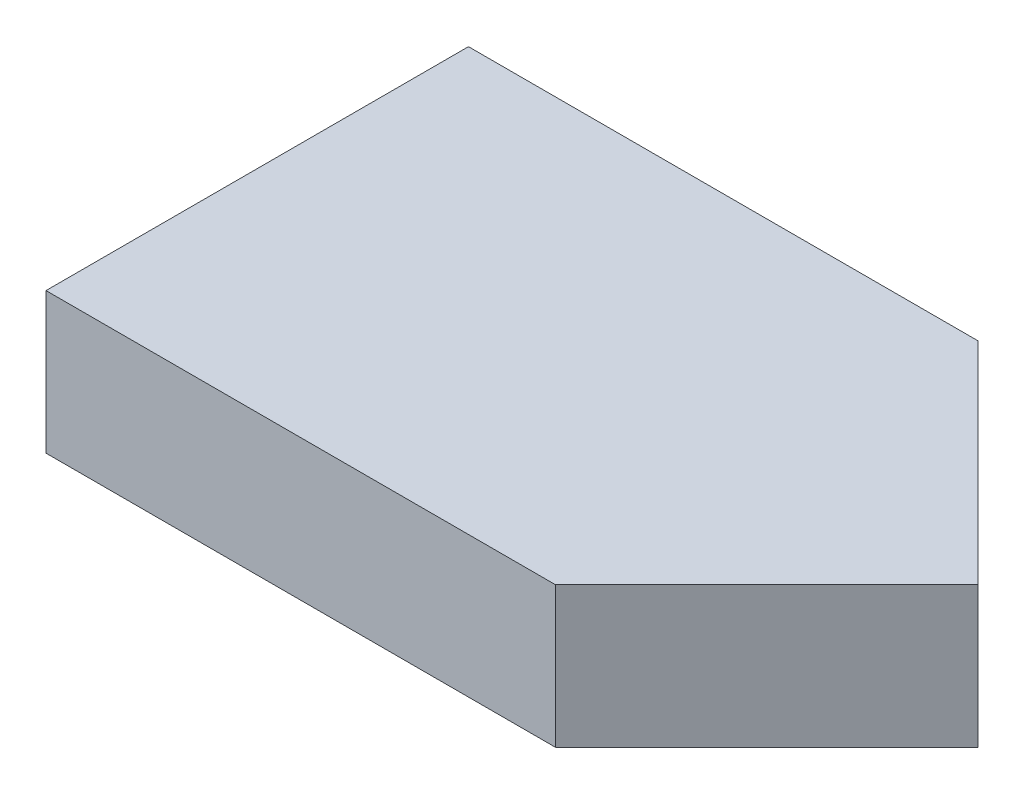
ISO-10303-21;
HEADER;
FILE_DESCRIPTION(('STEP AP214'),'2;1');
FILE_NAME('part.step','',(''),(''),'','','');
FILE_SCHEMA(('AUTOMOTIVE_DESIGN { 1 0 10303 214 1 1 1 1 }'));
ENDSEC;
DATA;
#1=APPLICATION_CONTEXT('core data for automotive mechanical design processes');
#2=APPLICATION_PROTOCOL_DEFINITION('international standard','automotive_design',2000,#1);
#3=PRODUCT_CONTEXT('',#1,'mechanical');
#4=PRODUCT('Part','Part','',(#3));
#5=PRODUCT_RELATED_PRODUCT_CATEGORY('part','',(#4));
#6=PRODUCT_DEFINITION_FORMATION('','',#4);
#7=PRODUCT_DEFINITION_CONTEXT('part definition',#1,'design');
#8=PRODUCT_DEFINITION('design','',#6,#7);
#9=PRODUCT_DEFINITION_SHAPE('','',#8);
#10=(LENGTH_UNIT() NAMED_UNIT(*) SI_UNIT(.MILLI.,.METRE.));
#11=(NAMED_UNIT(*) PLANE_ANGLE_UNIT() SI_UNIT($,.RADIAN.));
#12=(NAMED_UNIT(*) SI_UNIT($,.STERADIAN.) SOLID_ANGLE_UNIT());
#13=UNCERTAINTY_MEASURE_WITH_UNIT(LENGTH_MEASURE(1.E-05),#10,'distance_accuracy_value','');
#14=(GEOMETRIC_REPRESENTATION_CONTEXT(3) GLOBAL_UNCERTAINTY_ASSIGNED_CONTEXT((#13)) GLOBAL_UNIT_ASSIGNED_CONTEXT((#10,
#11,#12)) REPRESENTATION_CONTEXT('',''));
#15=CARTESIAN_POINT('',(0.,0.,0.));
#16=DIRECTION('',(0.,0.,1.));
#17=DIRECTION('',(1.,0.,0.));
#18=AXIS2_PLACEMENT_3D('',#15,#16,#17);
#19=CARTESIAN_POINT('',(38.8259698766486,25.4,-129.274030123351));
#20=DIRECTION('',(0.707106781186548,0.,-0.707106781186547));
#21=DIRECTION('',(-0.707106781186547,0.,-0.707106781186548));
#22=AXIS2_PLACEMENT_3D('',#19,#20,#21);
#23=PLANE('',#22);
#24=DIRECTION('',(0.707106781186547,0.,0.707106781186548));
#25=VECTOR('',#24,1.);
#26=CARTESIAN_POINT('',(38.8259698766486,0.,-129.274030123351));
#27=LINE('',#26,#25);
#28=CARTESIAN_POINT('',(91.9,0.,-76.2));
#29=VERTEX_POINT('',#28);
#30=CARTESIAN_POINT('',(130.,0.,-38.1));
#31=VERTEX_POINT('',#30);
#32=EDGE_CURVE('E108',#29,#31,#27,.T.);
#33=ORIENTED_EDGE('',*,*,#32,.F.);
#34=DIRECTION('',(0.,-1.,0.));
#35=VECTOR('',#34,1.);
#36=CARTESIAN_POINT('',(91.9,25.4,-76.2));
#37=LINE('',#36,#35);
#38=CARTESIAN_POINT('',(91.9,25.4,-76.2));
#39=VERTEX_POINT('',#38);
#40=EDGE_CURVE('E11',#39,#29,#37,.T.);
#41=ORIENTED_EDGE('',*,*,#40,.F.);
#42=DIRECTION('',(0.707106781186547,0.,0.707106781186548));
#43=VECTOR('',#42,1.);
#44=CARTESIAN_POINT('',(38.8259698766486,25.4,-129.274030123351));
#45=LINE('',#44,#43);
#46=CARTESIAN_POINT('',(130.,25.4,-38.1));
#47=VERTEX_POINT('',#46);
#48=EDGE_CURVE('E103',#39,#47,#45,.T.);
#49=ORIENTED_EDGE('',*,*,#48,.T.);
#50=DIRECTION('',(0.,-1.,0.));
#51=VECTOR('',#50,1.);
#52=CARTESIAN_POINT('',(130.,25.4,-38.1));
#53=LINE('',#52,#51);
#54=EDGE_CURVE('E49',#47,#31,#53,.T.);
#55=ORIENTED_EDGE('',*,*,#54,.T.);
#56=EDGE_LOOP('',(#33,#41,#49,#55));
#57=FACE_BOUND('',#56,.T.);
#58=ADVANCED_FACE('F33',(#57),#23,.T.);
#59=CARTESIAN_POINT('',(-52.3480602467029,25.4,-76.2));
#60=DIRECTION('',(0.,0.,-1.));
#61=DIRECTION('',(-1.,0.,0.));
#62=AXIS2_PLACEMENT_3D('',#59,#60,#61);
#63=PLANE('',#62);
#64=DIRECTION('',(1.,0.,0.));
#65=VECTOR('',#64,1.);
#66=CARTESIAN_POINT('',(-52.3480602467029,0.,-76.2));
#67=LINE('',#66,#65);
#68=CARTESIAN_POINT('',(0.,0.,-76.2));
#69=VERTEX_POINT('',#68);
#70=EDGE_CURVE('E110',#69,#29,#67,.T.);
#71=ORIENTED_EDGE('',*,*,#70,.F.);
#72=DIRECTION('',(0.,-1.,0.));
#73=VECTOR('',#72,1.);
#74=CARTESIAN_POINT('',(0.,25.4,-76.2));
#75=LINE('',#74,#73);
#76=CARTESIAN_POINT('',(0.,25.4,-76.2));
#77=VERTEX_POINT('',#76);
#78=EDGE_CURVE('E41',#77,#69,#75,.T.);
#79=ORIENTED_EDGE('',*,*,#78,.F.);
#80=DIRECTION('',(1.,0.,0.));
#81=VECTOR('',#80,1.);
#82=CARTESIAN_POINT('',(-52.3480602467029,25.4,-76.2));
#83=LINE('',#82,#81);
#84=EDGE_CURVE('E101',#77,#39,#83,.T.);
#85=ORIENTED_EDGE('',*,*,#84,.T.);
#86=ORIENTED_EDGE('',*,*,#40,.T.);
#87=EDGE_LOOP('',(#71,#79,#85,#86));
#88=FACE_BOUND('',#87,.T.);
#89=ADVANCED_FACE('F122',(#88),#63,.T.);
#90=CARTESIAN_POINT('',(0.,25.4,-38.1));
#91=DIRECTION('',(-1.,0.,0.));
#92=DIRECTION('',(0.,0.,1.));
#93=AXIS2_PLACEMENT_3D('',#90,#91,#92);
#94=PLANE('',#93);
#95=DIRECTION('',(0.,0.,-1.));
#96=VECTOR('',#95,1.);
#97=CARTESIAN_POINT('',(0.,0.,-38.1));
#98=LINE('',#97,#96);
#99=CARTESIAN_POINT('',(0.,0.,0.));
#100=VERTEX_POINT('',#99);
#101=EDGE_CURVE('E88',#100,#69,#98,.T.);
#102=ORIENTED_EDGE('',*,*,#101,.F.);
#103=DIRECTION('',(0.,-1.,0.));
#104=VECTOR('',#103,1.);
#105=CARTESIAN_POINT('',(0.,25.4,0.));
#106=LINE('',#105,#104);
#107=CARTESIAN_POINT('',(0.,25.4,0.));
#108=VERTEX_POINT('',#107);
#109=EDGE_CURVE('E82',#108,#100,#106,.T.);
#110=ORIENTED_EDGE('',*,*,#109,.F.);
#111=DIRECTION('',(0.,0.,-1.));
#112=VECTOR('',#111,1.);
#113=CARTESIAN_POINT('',(0.,25.4,-38.1));
#114=LINE('',#113,#112);
#115=EDGE_CURVE('E86',#108,#77,#114,.T.);
#116=ORIENTED_EDGE('',*,*,#115,.T.);
#117=ORIENTED_EDGE('',*,*,#78,.T.);
#118=EDGE_LOOP('',(#102,#110,#116,#117));
#119=FACE_BOUND('',#118,.T.);
#120=ADVANCED_FACE('F84',(#119),#94,.T.);
#121=CARTESIAN_POINT('',(-52.3480602467029,25.4,0.));
#122=DIRECTION('',(0.,0.,-1.));
#123=DIRECTION('',(-1.,0.,0.));
#124=AXIS2_PLACEMENT_3D('',#121,#122,#123);
#125=PLANE('',#124);
#126=DIRECTION('',(1.,0.,0.));
#127=VECTOR('',#126,1.);
#128=CARTESIAN_POINT('',(-52.3480602467029,0.,0.));
#129=LINE('',#128,#127);
#130=CARTESIAN_POINT('',(91.9,0.,0.));
#131=VERTEX_POINT('',#130);
#132=EDGE_CURVE('E114',#100,#131,#129,.T.);
#133=ORIENTED_EDGE('',*,*,#132,.T.);
#134=DIRECTION('',(0.,-1.,0.));
#135=VECTOR('',#134,1.);
#136=CARTESIAN_POINT('',(91.9,25.4,0.));
#137=LINE('',#136,#135);
#138=CARTESIAN_POINT('',(91.9,25.4,0.));
#139=VERTEX_POINT('',#138);
#140=EDGE_CURVE('E66',#139,#131,#137,.T.);
#141=ORIENTED_EDGE('',*,*,#140,.F.);
#142=DIRECTION('',(1.,0.,0.));
#143=VECTOR('',#142,1.);
#144=CARTESIAN_POINT('',(-52.3480602467029,25.4,0.));
#145=LINE('',#144,#143);
#146=EDGE_CURVE('E92',#108,#139,#145,.T.);
#147=ORIENTED_EDGE('',*,*,#146,.F.);
#148=ORIENTED_EDGE('',*,*,#109,.T.);
#149=EDGE_LOOP('',(#133,#141,#147,#148));
#150=FACE_BOUND('',#149,.T.);
#151=ADVANCED_FACE('F93',(#150),#125,.F.);
#152=CARTESIAN_POINT('',(38.8259698766485,25.4,53.0740301233514));
#153=DIRECTION('',(0.707106781186548,0.,0.707106781186548));
#154=DIRECTION('',(0.707106781186548,0.,-0.707106781186548));
#155=AXIS2_PLACEMENT_3D('',#152,#153,#154);
#156=PLANE('',#155);
#157=DIRECTION('',(-0.707106781186548,0.,0.707106781186548));
#158=VECTOR('',#157,1.);
#159=CARTESIAN_POINT('',(38.8259698766485,0.,53.0740301233514));
#160=LINE('',#159,#158);
#161=EDGE_CURVE('E116',#31,#131,#160,.T.);
#162=ORIENTED_EDGE('',*,*,#161,.F.);
#163=ORIENTED_EDGE('',*,*,#54,.F.);
#164=DIRECTION('',(-0.707106781186548,0.,0.707106781186548));
#165=VECTOR('',#164,1.);
#166=CARTESIAN_POINT('',(38.8259698766485,25.4,53.0740301233514));
#167=LINE('',#166,#165);
#168=EDGE_CURVE('E96',#47,#139,#167,.T.);
#169=ORIENTED_EDGE('',*,*,#168,.T.);
#170=ORIENTED_EDGE('',*,*,#140,.T.);
#171=EDGE_LOOP('',(#162,#163,#169,#170));
#172=FACE_BOUND('',#171,.T.);
#173=ADVANCED_FACE('F125',(#172),#156,.T.);
#174=CARTESIAN_POINT('',(-52.3480602467029,25.4,-38.1));
#175=DIRECTION('',(0.,1.,0.));
#176=DIRECTION('',(0.,0.,1.));
#177=AXIS2_PLACEMENT_3D('',#174,#175,#176);
#178=PLANE('',#177);
#179=ORIENTED_EDGE('',*,*,#48,.F.);
#180=ORIENTED_EDGE('',*,*,#84,.F.);
#181=ORIENTED_EDGE('',*,*,#115,.F.);
#182=ORIENTED_EDGE('',*,*,#146,.T.);
#183=ORIENTED_EDGE('',*,*,#168,.F.);
#184=EDGE_LOOP('',(#179,#180,#181,#182,#183));
#185=FACE_BOUND('',#184,.T.);
#186=ADVANCED_FACE('F99',(#185),#178,.T.);
#187=CARTESIAN_POINT('',(-52.3480602467029,0.,-38.1));
#188=DIRECTION('',(0.,1.,0.));
#189=DIRECTION('',(0.,0.,1.));
#190=AXIS2_PLACEMENT_3D('',#187,#188,#189);
#191=PLANE('',#190);
#192=ORIENTED_EDGE('',*,*,#32,.T.);
#193=ORIENTED_EDGE('',*,*,#161,.T.);
#194=ORIENTED_EDGE('',*,*,#132,.F.);
#195=ORIENTED_EDGE('',*,*,#101,.T.);
#196=ORIENTED_EDGE('',*,*,#70,.T.);
#197=EDGE_LOOP('',(#192,#193,#194,#195,#196));
#198=FACE_BOUND('',#197,.T.);
#199=ADVANCED_FACE('F124',(#198),#191,.F.);
#200=CLOSED_SHELL('',(#58,#89,#120,#151,#173,#186,#199));
#201=MANIFOLD_SOLID_BREP('B2',#200);
#202=ADVANCED_BREP_SHAPE_REPRESENTATION('',(#18,#201),#14);
#203=SHAPE_DEFINITION_REPRESENTATION(#9,#202);
ENDSEC;
END-ISO-10303-21;
